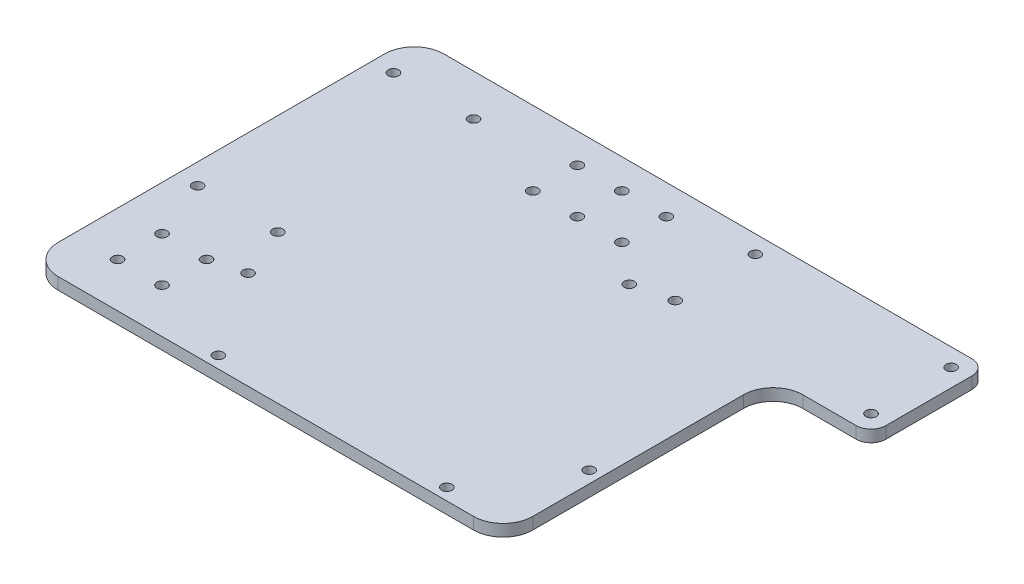
ISO-10303-21;
HEADER;
FILE_DESCRIPTION(('STEP AP214'),'2;1');
FILE_NAME('part.step','',(''),(''),'','','');
FILE_SCHEMA(('AUTOMOTIVE_DESIGN { 1 0 10303 214 1 1 1 1 }'));
ENDSEC;
DATA;
#1=APPLICATION_CONTEXT('core data for automotive mechanical design processes');
#2=APPLICATION_PROTOCOL_DEFINITION('international standard','automotive_design',2000,#1);
#3=PRODUCT_CONTEXT('',#1,'mechanical');
#4=PRODUCT('Part','Part','',(#3));
#5=PRODUCT_RELATED_PRODUCT_CATEGORY('part','',(#4));
#6=PRODUCT_DEFINITION_FORMATION('','',#4);
#7=PRODUCT_DEFINITION_CONTEXT('part definition',#1,'design');
#8=PRODUCT_DEFINITION('design','',#6,#7);
#9=PRODUCT_DEFINITION_SHAPE('','',#8);
#10=(LENGTH_UNIT() NAMED_UNIT(*) SI_UNIT(.MILLI.,.METRE.));
#11=(NAMED_UNIT(*) PLANE_ANGLE_UNIT() SI_UNIT($,.RADIAN.));
#12=(NAMED_UNIT(*) SI_UNIT($,.STERADIAN.) SOLID_ANGLE_UNIT());
#13=UNCERTAINTY_MEASURE_WITH_UNIT(LENGTH_MEASURE(1.E-05),#10,'distance_accuracy_value','');
#14=(GEOMETRIC_REPRESENTATION_CONTEXT(3) GLOBAL_UNCERTAINTY_ASSIGNED_CONTEXT((#13)) GLOBAL_UNIT_ASSIGNED_CONTEXT((#10,
#11,#12)) REPRESENTATION_CONTEXT('',''));
#15=CARTESIAN_POINT('',(0.,0.,0.));
#16=DIRECTION('',(0.,0.,1.));
#17=DIRECTION('',(1.,0.,0.));
#18=AXIS2_PLACEMENT_3D('',#15,#16,#17);
#19=CARTESIAN_POINT('',(80.,4.,-65.));
#20=DIRECTION('',(-1.,0.,0.));
#21=DIRECTION('',(0.,0.,1.));
#22=AXIS2_PLACEMENT_3D('',#19,#20,#21);
#23=PLANE('',#22);
#24=DIRECTION('',(0.,0.,-1.));
#25=VECTOR('',#24,1.);
#26=CARTESIAN_POINT('',(80.,0.,-65.));
#27=LINE('',#26,#25);
#28=CARTESIAN_POINT('',(80.,0.,55.));
#29=VERTEX_POINT('',#28);
#30=CARTESIAN_POINT('',(80.,0.,-16.));
#31=VERTEX_POINT('',#30);
#32=EDGE_CURVE('E144',#29,#31,#27,.T.);
#33=ORIENTED_EDGE('',*,*,#32,.T.);
#34=DIRECTION('',(0.,1.,0.));
#35=VECTOR('',#34,1.);
#36=CARTESIAN_POINT('',(80.,4.,-16.));
#37=LINE('',#36,#35);
#38=CARTESIAN_POINT('',(80.,4.,-16.));
#39=VERTEX_POINT('',#38);
#40=EDGE_CURVE('E148',#31,#39,#37,.T.);
#41=ORIENTED_EDGE('',*,*,#40,.T.);
#42=DIRECTION('',(0.,0.,-1.));
#43=VECTOR('',#42,1.);
#44=CARTESIAN_POINT('',(80.,4.,-65.));
#45=LINE('',#44,#43);
#46=CARTESIAN_POINT('',(80.,4.,55.));
#47=VERTEX_POINT('',#46);
#48=EDGE_CURVE('E147',#47,#39,#45,.T.);
#49=ORIENTED_EDGE('',*,*,#48,.F.);
#50=DIRECTION('',(0.,-1.,0.));
#51=VECTOR('',#50,1.);
#52=CARTESIAN_POINT('',(80.,4.,55.));
#53=LINE('',#52,#51);
#54=EDGE_CURVE('E132',#47,#29,#53,.T.);
#55=ORIENTED_EDGE('',*,*,#54,.T.);
#56=EDGE_LOOP('',(#33,#41,#49,#55));
#57=FACE_BOUND('',#56,.T.);
#58=ADVANCED_FACE('F37',(#57),#23,.F.);
#59=CARTESIAN_POINT('',(-80.,4.,-65.));
#60=DIRECTION('',(0.,0.,1.));
#61=DIRECTION('',(1.,0.,0.));
#62=AXIS2_PLACEMENT_3D('',#59,#60,#61);
#63=PLANE('',#62);
#64=DIRECTION('',(-1.,0.,0.));
#65=VECTOR('',#64,1.);
#66=CARTESIAN_POINT('',(-80.,4.,-65.));
#67=LINE('',#66,#65);
#68=CARTESIAN_POINT('',(108.,4.,-65.));
#69=VERTEX_POINT('',#68);
#70=CARTESIAN_POINT('',(-70.,4.,-65.));
#71=VERTEX_POINT('',#70);
#72=EDGE_CURVE('E199',#69,#71,#67,.T.);
#73=ORIENTED_EDGE('',*,*,#72,.F.);
#74=DIRECTION('',(0.,1.,0.));
#75=VECTOR('',#74,1.);
#76=CARTESIAN_POINT('',(108.,0.,-65.));
#77=LINE('',#76,#75);
#78=CARTESIAN_POINT('',(108.,0.,-65.));
#79=VERTEX_POINT('',#78);
#80=EDGE_CURVE('E60',#69,#79,#77,.F.);
#81=ORIENTED_EDGE('',*,*,#80,.T.);
#82=DIRECTION('',(-1.,0.,0.));
#83=VECTOR('',#82,1.);
#84=CARTESIAN_POINT('',(-80.,0.,-65.));
#85=LINE('',#84,#83);
#86=CARTESIAN_POINT('',(-70.,0.,-65.));
#87=VERTEX_POINT('',#86);
#88=EDGE_CURVE('E154',#79,#87,#85,.T.);
#89=ORIENTED_EDGE('',*,*,#88,.T.);
#90=DIRECTION('',(0.,-1.,0.));
#91=VECTOR('',#90,1.);
#92=CARTESIAN_POINT('',(-70.,4.,-65.));
#93=LINE('',#92,#91);
#94=EDGE_CURVE('E257',#87,#71,#93,.F.);
#95=ORIENTED_EDGE('',*,*,#94,.T.);
#96=EDGE_LOOP('',(#73,#81,#89,#95));
#97=FACE_BOUND('',#96,.T.);
#98=ADVANCED_FACE('F289',(#97),#63,.F.);
#99=CARTESIAN_POINT('',(-80.,4.,-65.));
#100=DIRECTION('',(1.,0.,0.));
#101=DIRECTION('',(0.,0.,-1.));
#102=AXIS2_PLACEMENT_3D('',#99,#100,#101);
#103=PLANE('',#102);
#104=DIRECTION('',(0.,0.,1.));
#105=VECTOR('',#104,1.);
#106=CARTESIAN_POINT('',(-80.,0.,-65.));
#107=LINE('',#106,#105);
#108=CARTESIAN_POINT('',(-80.,0.,-55.));
#109=VERTEX_POINT('',#108);
#110=CARTESIAN_POINT('',(-80.,0.,55.));
#111=VERTEX_POINT('',#110);
#112=EDGE_CURVE('E157',#109,#111,#107,.T.);
#113=ORIENTED_EDGE('',*,*,#112,.T.);
#114=DIRECTION('',(0.,-1.,0.));
#115=VECTOR('',#114,1.);
#116=CARTESIAN_POINT('',(-80.,4.,55.));
#117=LINE('',#116,#115);
#118=CARTESIAN_POINT('',(-80.,4.,55.));
#119=VERTEX_POINT('',#118);
#120=EDGE_CURVE('E260',#111,#119,#117,.F.);
#121=ORIENTED_EDGE('',*,*,#120,.T.);
#122=DIRECTION('',(0.,0.,1.));
#123=VECTOR('',#122,1.);
#124=CARTESIAN_POINT('',(-80.,4.,-65.));
#125=LINE('',#124,#123);
#126=CARTESIAN_POINT('',(-80.,4.,-55.));
#127=VERTEX_POINT('',#126);
#128=EDGE_CURVE('E195',#127,#119,#125,.T.);
#129=ORIENTED_EDGE('',*,*,#128,.F.);
#130=DIRECTION('',(0.,-1.,0.));
#131=VECTOR('',#130,1.);
#132=CARTESIAN_POINT('',(-80.,4.,-55.));
#133=LINE('',#132,#131);
#134=EDGE_CURVE('E262',#127,#109,#133,.T.);
#135=ORIENTED_EDGE('',*,*,#134,.T.);
#136=EDGE_LOOP('',(#113,#121,#129,#135));
#137=FACE_BOUND('',#136,.T.);
#138=ADVANCED_FACE('F283',(#137),#103,.F.);
#139=CARTESIAN_POINT('',(-80.,4.,65.));
#140=DIRECTION('',(0.,0.,-1.));
#141=DIRECTION('',(-1.,0.,0.));
#142=AXIS2_PLACEMENT_3D('',#139,#140,#141);
#143=PLANE('',#142);
#144=DIRECTION('',(1.,0.,0.));
#145=VECTOR('',#144,1.);
#146=CARTESIAN_POINT('',(-80.,0.,65.));
#147=LINE('',#146,#145);
#148=CARTESIAN_POINT('',(-70.,0.,65.));
#149=VERTEX_POINT('',#148);
#150=CARTESIAN_POINT('',(70.,0.,65.));
#151=VERTEX_POINT('',#150);
#152=EDGE_CURVE('E168',#149,#151,#147,.T.);
#153=ORIENTED_EDGE('',*,*,#152,.T.);
#154=DIRECTION('',(0.,-1.,0.));
#155=VECTOR('',#154,1.);
#156=CARTESIAN_POINT('',(70.,4.,65.));
#157=LINE('',#156,#155);
#158=CARTESIAN_POINT('',(70.,4.,65.));
#159=VERTEX_POINT('',#158);
#160=EDGE_CURVE('E133',#151,#159,#157,.F.);
#161=ORIENTED_EDGE('',*,*,#160,.T.);
#162=DIRECTION('',(1.,0.,0.));
#163=VECTOR('',#162,1.);
#164=CARTESIAN_POINT('',(-80.,4.,65.));
#165=LINE('',#164,#163);
#166=CARTESIAN_POINT('',(-70.,4.,65.));
#167=VERTEX_POINT('',#166);
#168=EDGE_CURVE('E149',#167,#159,#165,.T.);
#169=ORIENTED_EDGE('',*,*,#168,.F.);
#170=DIRECTION('',(0.,-1.,0.));
#171=VECTOR('',#170,1.);
#172=CARTESIAN_POINT('',(-70.,4.,65.));
#173=LINE('',#172,#171);
#174=EDGE_CURVE('E137',#167,#149,#173,.T.);
#175=ORIENTED_EDGE('',*,*,#174,.T.);
#176=EDGE_LOOP('',(#153,#161,#169,#175));
#177=FACE_BOUND('',#176,.T.);
#178=ADVANCED_FACE('F279',(#177),#143,.F.);
#179=CARTESIAN_POINT('',(0.,4.,0.));
#180=DIRECTION('',(0.,1.,0.));
#181=DIRECTION('',(0.,0.,1.));
#182=AXIS2_PLACEMENT_3D('',#179,#180,#181);
#183=PLANE('',#182);
#184=CARTESIAN_POINT('',(-50.,4.,50.));
#185=DIRECTION('',(0.,1.,0.));
#186=DIRECTION('',(0.,0.,1.));
#187=AXIS2_PLACEMENT_3D('',#184,#185,#186);
#188=CIRCLE('',#187,1.75);
#189=CARTESIAN_POINT('',(-50.,4.,51.75));
#190=VERTEX_POINT('',#189);
#191=EDGE_CURVE('E713',#190,#190,#188,.T.);
#192=ORIENTED_EDGE('',*,*,#191,.F.);
#193=EDGE_LOOP('',(#192));
#194=FACE_BOUND('',#193,.T.);
#195=CARTESIAN_POINT('',(-65.,4.,35.));
#196=DIRECTION('',(0.,1.,0.));
#197=DIRECTION('',(0.,0.,1.));
#198=AXIS2_PLACEMENT_3D('',#195,#196,#197);
#199=CIRCLE('',#198,1.75);
#200=CARTESIAN_POINT('',(-65.,4.,36.75));
#201=VERTEX_POINT('',#200);
#202=EDGE_CURVE('E430',#201,#201,#199,.T.);
#203=ORIENTED_EDGE('',*,*,#202,.F.);
#204=EDGE_LOOP('',(#203));
#205=FACE_BOUND('',#204,.T.);
#206=CARTESIAN_POINT('',(-50.,4.,35.));
#207=DIRECTION('',(0.,1.,0.));
#208=DIRECTION('',(0.,0.,1.));
#209=AXIS2_PLACEMENT_3D('',#206,#207,#208);
#210=CIRCLE('',#209,1.75);
#211=CARTESIAN_POINT('',(-50.,4.,36.75));
#212=VERTEX_POINT('',#211);
#213=EDGE_CURVE('E424',#212,#212,#210,.T.);
#214=ORIENTED_EDGE('',*,*,#213,.F.);
#215=EDGE_LOOP('',(#214));
#216=FACE_BOUND('',#215,.T.);
#217=CARTESIAN_POINT('',(-65.,4.,50.));
#218=DIRECTION('',(0.,1.,0.));
#219=DIRECTION('',(0.,0.,1.));
#220=AXIS2_PLACEMENT_3D('',#217,#218,#219);
#221=CIRCLE('',#220,1.75);
#222=CARTESIAN_POINT('',(-65.,4.,51.75));
#223=VERTEX_POINT('',#222);
#224=EDGE_CURVE('E445',#223,#223,#221,.T.);
#225=ORIENTED_EDGE('',*,*,#224,.F.);
#226=EDGE_LOOP('',(#225));
#227=FACE_BOUND('',#226,.T.);
#228=CARTESIAN_POINT('',(107.,4.,-59.));
#229=DIRECTION('',(0.,1.,0.));
#230=DIRECTION('',(0.,0.,1.));
#231=AXIS2_PLACEMENT_3D('',#228,#229,#230);
#232=CIRCLE('',#231,1.75);
#233=CARTESIAN_POINT('',(107.,4.,-57.25));
#234=VERTEX_POINT('',#233);
#235=EDGE_CURVE('E452',#234,#234,#232,.T.);
#236=ORIENTED_EDGE('',*,*,#235,.F.);
#237=EDGE_LOOP('',(#236));
#238=FACE_BOUND('',#237,.T.);
#239=CARTESIAN_POINT('',(107.,4.,-32.));
#240=DIRECTION('',(0.,1.,0.));
#241=DIRECTION('',(0.,0.,1.));
#242=AXIS2_PLACEMENT_3D('',#239,#240,#241);
#243=CIRCLE('',#242,1.75);
#244=CARTESIAN_POINT('',(107.,4.,-30.25));
#245=VERTEX_POINT('',#244);
#246=EDGE_CURVE('E459',#245,#245,#243,.T.);
#247=ORIENTED_EDGE('',*,*,#246,.F.);
#248=EDGE_LOOP('',(#247));
#249=FACE_BOUND('',#248,.T.);
#250=CARTESIAN_POINT('',(-15.,4.,-54.9999999999999));
#251=DIRECTION('',(0.,1.,0.));
#252=DIRECTION('',(0.,0.,1.));
#253=AXIS2_PLACEMENT_3D('',#250,#251,#252);
#254=CIRCLE('',#253,1.75);
#255=CARTESIAN_POINT('',(-15.,4.,-53.2499999999999));
#256=VERTEX_POINT('',#255);
#257=EDGE_CURVE('E468',#256,#256,#254,.T.);
#258=ORIENTED_EDGE('',*,*,#257,.F.);
#259=EDGE_LOOP('',(#258));
#260=FACE_BOUND('',#259,.T.);
#261=CARTESIAN_POINT('',(15.,4.,-40.));
#262=DIRECTION('',(0.,1.,0.));
#263=DIRECTION('',(0.,0.,1.));
#264=AXIS2_PLACEMENT_3D('',#261,#262,#263);
#265=CIRCLE('',#264,1.75);
#266=CARTESIAN_POINT('',(15.,4.,-38.25));
#267=VERTEX_POINT('',#266);
#268=EDGE_CURVE('E501',#267,#267,#265,.T.);
#269=ORIENTED_EDGE('',*,*,#268,.F.);
#270=EDGE_LOOP('',(#269));
#271=FACE_BOUND('',#270,.T.);
#272=CARTESIAN_POINT('',(15.,4.,-55.));
#273=DIRECTION('',(0.,1.,0.));
#274=DIRECTION('',(0.,0.,1.));
#275=AXIS2_PLACEMENT_3D('',#272,#273,#274);
#276=CIRCLE('',#275,1.75);
#277=CARTESIAN_POINT('',(15.,4.,-53.25));
#278=VERTEX_POINT('',#277);
#279=EDGE_CURVE('E500',#278,#278,#276,.T.);
#280=ORIENTED_EDGE('',*,*,#279,.F.);
#281=EDGE_LOOP('',(#280));
#282=FACE_BOUND('',#281,.T.);
#283=CARTESIAN_POINT('',(0.,4.,-40.));
#284=DIRECTION('',(0.,1.,0.));
#285=DIRECTION('',(0.,0.,1.));
#286=AXIS2_PLACEMENT_3D('',#283,#284,#285);
#287=CIRCLE('',#286,1.75);
#288=CARTESIAN_POINT('',(0.,4.,-38.25));
#289=VERTEX_POINT('',#288);
#290=EDGE_CURVE('E480',#289,#289,#287,.T.);
#291=ORIENTED_EDGE('',*,*,#290,.F.);
#292=EDGE_LOOP('',(#291));
#293=FACE_BOUND('',#292,.T.);
#294=CARTESIAN_POINT('',(-15.,4.,-39.9999999999999));
#295=DIRECTION('',(0.,1.,0.));
#296=DIRECTION('',(0.,0.,1.));
#297=AXIS2_PLACEMENT_3D('',#294,#295,#296);
#298=CIRCLE('',#297,1.75);
#299=CARTESIAN_POINT('',(-15.,4.,-38.2499999999999));
#300=VERTEX_POINT('',#299);
#301=EDGE_CURVE('E493',#300,#300,#298,.T.);
#302=ORIENTED_EDGE('',*,*,#301,.F.);
#303=EDGE_LOOP('',(#302));
#304=FACE_BOUND('',#303,.T.);
#305=CARTESIAN_POINT('',(0.,4.,-55.));
#306=DIRECTION('',(0.,1.,0.));
#307=DIRECTION('',(0.,0.,1.));
#308=AXIS2_PLACEMENT_3D('',#305,#306,#307);
#309=CIRCLE('',#308,1.75);
#310=CARTESIAN_POINT('',(0.,4.,-53.25));
#311=VERTEX_POINT('',#310);
#312=EDGE_CURVE('E479',#311,#311,#309,.T.);
#313=ORIENTED_EDGE('',*,*,#312,.F.);
#314=EDGE_LOOP('',(#313));
#315=FACE_BOUND('',#314,.T.);
#316=CARTESIAN_POINT('',(28.5,4.,-29.));
#317=DIRECTION('',(0.,1.,0.));
#318=DIRECTION('',(0.,0.,1.));
#319=AXIS2_PLACEMENT_3D('',#316,#317,#318);
#320=CIRCLE('',#319,1.75);
#321=CARTESIAN_POINT('',(28.5,4.,-27.25));
#322=VERTEX_POINT('',#321);
#323=EDGE_CURVE('E530',#322,#322,#320,.T.);
#324=ORIENTED_EDGE('',*,*,#323,.F.);
#325=EDGE_LOOP('',(#324));
#326=FACE_BOUND('',#325,.T.);
#327=CARTESIAN_POINT('',(76.,4.,32.));
#328=DIRECTION('',(0.,1.,0.));
#329=DIRECTION('',(0.,0.,1.));
#330=AXIS2_PLACEMENT_3D('',#327,#328,#329);
#331=CIRCLE('',#330,1.75);
#332=CARTESIAN_POINT('',(76.,4.,33.75));
#333=VERTEX_POINT('',#332);
#334=EDGE_CURVE('E534',#333,#333,#331,.T.);
#335=ORIENTED_EDGE('',*,*,#334,.F.);
#336=EDGE_LOOP('',(#335));
#337=FACE_BOUND('',#336,.T.);
#338=CARTESIAN_POINT('',(-39.,4.,32.));
#339=DIRECTION('',(0.,1.,0.));
#340=DIRECTION('',(0.,0.,1.));
#341=AXIS2_PLACEMENT_3D('',#338,#339,#340);
#342=CIRCLE('',#341,1.75);
#343=CARTESIAN_POINT('',(-39.,4.,33.75));
#344=VERTEX_POINT('',#343);
#345=EDGE_CURVE('E538',#344,#344,#342,.T.);
#346=ORIENTED_EDGE('',*,*,#345,.F.);
#347=EDGE_LOOP('',(#346));
#348=FACE_BOUND('',#347,.T.);
#349=CARTESIAN_POINT('',(-20.,4.,61.));
#350=DIRECTION('',(0.,1.,0.));
#351=DIRECTION('',(0.,0.,1.));
#352=AXIS2_PLACEMENT_3D('',#349,#350,#351);
#353=CIRCLE('',#352,1.75);
#354=CARTESIAN_POINT('',(-20.,4.,62.75));
#355=VERTEX_POINT('',#354);
#356=EDGE_CURVE('E542',#355,#355,#353,.T.);
#357=ORIENTED_EDGE('',*,*,#356,.F.);
#358=EDGE_LOOP('',(#357));
#359=FACE_BOUND('',#358,.T.);
#360=CARTESIAN_POINT('',(57.,4.,61.));
#361=DIRECTION('',(0.,1.,0.));
#362=DIRECTION('',(0.,0.,1.));
#363=AXIS2_PLACEMENT_3D('',#360,#361,#362);
#364=CIRCLE('',#363,1.75);
#365=CARTESIAN_POINT('',(57.,4.,62.75));
#366=VERTEX_POINT('',#365);
#367=EDGE_CURVE('E546',#366,#366,#364,.T.);
#368=ORIENTED_EDGE('',*,*,#367,.F.);
#369=EDGE_LOOP('',(#368));
#370=FACE_BOUND('',#369,.T.);
#371=CARTESIAN_POINT('',(41.,4.,-59.));
#372=DIRECTION('',(0.,1.,0.));
#373=DIRECTION('',(0.,0.,1.));
#374=AXIS2_PLACEMENT_3D('',#371,#372,#373);
#375=CIRCLE('',#374,1.75);
#376=CARTESIAN_POINT('',(41.,4.,-57.25));
#377=VERTEX_POINT('',#376);
#378=EDGE_CURVE('E550',#377,#377,#375,.T.);
#379=ORIENTED_EDGE('',*,*,#378,.F.);
#380=EDGE_LOOP('',(#379));
#381=FACE_BOUND('',#380,.T.);
#382=CARTESIAN_POINT('',(41.,4.,-32.));
#383=DIRECTION('',(0.,1.,0.));
#384=DIRECTION('',(0.,0.,1.));
#385=AXIS2_PLACEMENT_3D('',#382,#383,#384);
#386=CIRCLE('',#385,1.75000000000001);
#387=CARTESIAN_POINT('',(41.,4.,-30.25));
#388=VERTEX_POINT('',#387);
#389=EDGE_CURVE('E554',#388,#388,#386,.T.);
#390=ORIENTED_EDGE('',*,*,#389,.F.);
#391=EDGE_LOOP('',(#390));
#392=FACE_BOUND('',#391,.T.);
#393=CARTESIAN_POINT('',(-73.,4.,-51.));
#394=DIRECTION('',(0.,1.,0.));
#395=DIRECTION('',(0.,0.,1.));
#396=AXIS2_PLACEMENT_3D('',#393,#394,#395);
#397=CIRCLE('',#396,1.75);
#398=CARTESIAN_POINT('',(-73.,4.,-49.25));
#399=VERTEX_POINT('',#398);
#400=EDGE_CURVE('E558',#399,#399,#397,.T.);
#401=ORIENTED_EDGE('',*,*,#400,.F.);
#402=EDGE_LOOP('',(#401));
#403=FACE_BOUND('',#402,.T.);
#404=CARTESIAN_POINT('',(-46.,4.,15.));
#405=DIRECTION('',(0.,1.,0.));
#406=DIRECTION('',(0.,0.,1.));
#407=AXIS2_PLACEMENT_3D('',#404,#405,#406);
#408=CIRCLE('',#407,1.75);
#409=CARTESIAN_POINT('',(-46.,4.,16.75));
#410=VERTEX_POINT('',#409);
#411=EDGE_CURVE('E562',#410,#410,#408,.T.);
#412=ORIENTED_EDGE('',*,*,#411,.F.);
#413=EDGE_LOOP('',(#412));
#414=FACE_BOUND('',#413,.T.);
#415=CARTESIAN_POINT('',(-46.,4.,-51.));
#416=DIRECTION('',(0.,1.,0.));
#417=DIRECTION('',(0.,0.,1.));
#418=AXIS2_PLACEMENT_3D('',#415,#416,#417);
#419=CIRCLE('',#418,1.75);
#420=CARTESIAN_POINT('',(-46.,4.,-49.25));
#421=VERTEX_POINT('',#420);
#422=EDGE_CURVE('E566',#421,#421,#419,.T.);
#423=ORIENTED_EDGE('',*,*,#422,.F.);
#424=EDGE_LOOP('',(#423));
#425=FACE_BOUND('',#424,.T.);
#426=CARTESIAN_POINT('',(-73.,4.,15.));
#427=DIRECTION('',(0.,1.,0.));
#428=DIRECTION('',(0.,0.,1.));
#429=AXIS2_PLACEMENT_3D('',#426,#427,#428);
#430=CIRCLE('',#429,1.75);
#431=CARTESIAN_POINT('',(-73.,4.,16.75));
#432=VERTEX_POINT('',#431);
#433=EDGE_CURVE('E160',#432,#432,#430,.T.);
#434=ORIENTED_EDGE('',*,*,#433,.F.);
#435=EDGE_LOOP('',(#434));
#436=FACE_BOUND('',#435,.T.);
#437=DIRECTION('',(0.,0.,-1.));
#438=VECTOR('',#437,1.);
#439=CARTESIAN_POINT('',(113.,4.,-65.));
#440=LINE('',#439,#438);
#441=CARTESIAN_POINT('',(113.,4.,-31.));
#442=VERTEX_POINT('',#441);
#443=CARTESIAN_POINT('',(113.,4.,-60.));
#444=VERTEX_POINT('',#443);
#445=EDGE_CURVE('E216',#442,#444,#440,.T.);
#446=ORIENTED_EDGE('',*,*,#445,.T.);
#447=CARTESIAN_POINT('',(108.,4.,-60.));
#448=DIRECTION('',(0.,1.,0.));
#449=DIRECTION('',(0.,0.,1.));
#450=AXIS2_PLACEMENT_3D('',#447,#448,#449);
#451=CIRCLE('',#450,5.);
#452=EDGE_CURVE('E230',#444,#69,#451,.T.);
#453=ORIENTED_EDGE('',*,*,#452,.T.);
#454=ORIENTED_EDGE('',*,*,#72,.T.);
#455=CARTESIAN_POINT('',(-70.,4.,-55.));
#456=DIRECTION('',(0.,1.,0.));
#457=DIRECTION('',(0.,0.,1.));
#458=AXIS2_PLACEMENT_3D('',#455,#456,#457);
#459=CIRCLE('',#458,10.);
#460=EDGE_CURVE('E181',#71,#127,#459,.T.);
#461=ORIENTED_EDGE('',*,*,#460,.T.);
#462=ORIENTED_EDGE('',*,*,#128,.T.);
#463=CARTESIAN_POINT('',(-70.,4.,55.));
#464=DIRECTION('',(0.,1.,0.));
#465=DIRECTION('',(0.,0.,1.));
#466=AXIS2_PLACEMENT_3D('',#463,#464,#465);
#467=CIRCLE('',#466,10.);
#468=EDGE_CURVE('E185',#119,#167,#467,.T.);
#469=ORIENTED_EDGE('',*,*,#468,.T.);
#470=ORIENTED_EDGE('',*,*,#168,.T.);
#471=CARTESIAN_POINT('',(70.,4.,55.));
#472=DIRECTION('',(0.,1.,0.));
#473=DIRECTION('',(0.,0.,1.));
#474=AXIS2_PLACEMENT_3D('',#471,#472,#473);
#475=CIRCLE('',#474,10.);
#476=EDGE_CURVE('E264',#159,#47,#475,.T.);
#477=ORIENTED_EDGE('',*,*,#476,.T.);
#478=ORIENTED_EDGE('',*,*,#48,.T.);
#479=CARTESIAN_POINT('',(90.,4.,-16.));
#480=DIRECTION('',(0.,1.,0.));
#481=DIRECTION('',(0.,0.,1.));
#482=AXIS2_PLACEMENT_3D('',#479,#480,#481);
#483=CIRCLE('',#482,10.);
#484=CARTESIAN_POINT('',(90.,4.,-26.));
#485=VERTEX_POINT('',#484);
#486=EDGE_CURVE('E254',#39,#485,#483,.F.);
#487=ORIENTED_EDGE('',*,*,#486,.T.);
#488=DIRECTION('',(1.,0.,0.));
#489=VECTOR('',#488,1.);
#490=CARTESIAN_POINT('',(80.,4.,-26.));
#491=LINE('',#490,#489);
#492=CARTESIAN_POINT('',(108.,4.,-26.));
#493=VERTEX_POINT('',#492);
#494=EDGE_CURVE('E210',#485,#493,#491,.T.);
#495=ORIENTED_EDGE('',*,*,#494,.T.);
#496=CARTESIAN_POINT('',(108.,4.,-31.));
#497=DIRECTION('',(0.,1.,0.));
#498=DIRECTION('',(0.,0.,1.));
#499=AXIS2_PLACEMENT_3D('',#496,#497,#498);
#500=CIRCLE('',#499,5.);
#501=EDGE_CURVE('E234',#493,#442,#500,.T.);
#502=ORIENTED_EDGE('',*,*,#501,.T.);
#503=EDGE_LOOP('',(#446,#453,#454,#461,#462,#469,#470,#477,#478,#487,#495,#502));
#504=FACE_BOUND('',#503,.T.);
#505=ADVANCED_FACE('F273',(#194,#205,#216,#227,#238,#249,#260,#271,#282,#293,#304,#315,#326,
#337,#348,#359,#370,#381,#392,#403,#414,#425,#436,#504),#183,.T.);
#506=CARTESIAN_POINT('',(0.,0.,0.));
#507=DIRECTION('',(0.,1.,0.));
#508=DIRECTION('',(0.,0.,1.));
#509=AXIS2_PLACEMENT_3D('',#506,#507,#508);
#510=PLANE('',#509);
#511=CARTESIAN_POINT('',(-50.,0.,50.));
#512=DIRECTION('',(0.,1.,0.));
#513=DIRECTION('',(0.,0.,1.));
#514=AXIS2_PLACEMENT_3D('',#511,#512,#513);
#515=CIRCLE('',#514,1.75);
#516=CARTESIAN_POINT('',(-50.,0.,51.75));
#517=VERTEX_POINT('',#516);
#518=EDGE_CURVE('E434',#517,#517,#515,.T.);
#519=ORIENTED_EDGE('',*,*,#518,.T.);
#520=EDGE_LOOP('',(#519));
#521=FACE_BOUND('',#520,.T.);
#522=CARTESIAN_POINT('',(-65.,0.,35.));
#523=DIRECTION('',(0.,1.,0.));
#524=DIRECTION('',(0.,0.,1.));
#525=AXIS2_PLACEMENT_3D('',#522,#523,#524);
#526=CIRCLE('',#525,1.75);
#527=CARTESIAN_POINT('',(-65.,0.,36.75));
#528=VERTEX_POINT('',#527);
#529=EDGE_CURVE('E711',#528,#528,#526,.T.);
#530=ORIENTED_EDGE('',*,*,#529,.T.);
#531=EDGE_LOOP('',(#530));
#532=FACE_BOUND('',#531,.T.);
#533=CARTESIAN_POINT('',(-50.,0.,35.));
#534=DIRECTION('',(0.,1.,0.));
#535=DIRECTION('',(0.,0.,1.));
#536=AXIS2_PLACEMENT_3D('',#533,#534,#535);
#537=CIRCLE('',#536,1.75);
#538=CARTESIAN_POINT('',(-50.,0.,36.75));
#539=VERTEX_POINT('',#538);
#540=EDGE_CURVE('E421',#539,#539,#537,.T.);
#541=ORIENTED_EDGE('',*,*,#540,.T.);
#542=EDGE_LOOP('',(#541));
#543=FACE_BOUND('',#542,.T.);
#544=CARTESIAN_POINT('',(-65.,0.,50.));
#545=DIRECTION('',(0.,1.,0.));
#546=DIRECTION('',(0.,0.,1.));
#547=AXIS2_PLACEMENT_3D('',#544,#545,#546);
#548=CIRCLE('',#547,1.75);
#549=CARTESIAN_POINT('',(-65.,0.,51.75));
#550=VERTEX_POINT('',#549);
#551=EDGE_CURVE('E450',#550,#550,#548,.T.);
#552=ORIENTED_EDGE('',*,*,#551,.T.);
#553=EDGE_LOOP('',(#552));
#554=FACE_BOUND('',#553,.T.);
#555=CARTESIAN_POINT('',(107.,0.,-59.));
#556=DIRECTION('',(0.,1.,0.));
#557=DIRECTION('',(0.,0.,1.));
#558=AXIS2_PLACEMENT_3D('',#555,#556,#557);
#559=CIRCLE('',#558,1.75);
#560=CARTESIAN_POINT('',(107.,0.,-57.25));
#561=VERTEX_POINT('',#560);
#562=EDGE_CURVE('E217',#561,#561,#559,.T.);
#563=ORIENTED_EDGE('',*,*,#562,.T.);
#564=EDGE_LOOP('',(#563));
#565=FACE_BOUND('',#564,.T.);
#566=CARTESIAN_POINT('',(107.,0.,-32.));
#567=DIRECTION('',(0.,1.,0.));
#568=DIRECTION('',(0.,0.,1.));
#569=AXIS2_PLACEMENT_3D('',#566,#567,#568);
#570=CIRCLE('',#569,1.75);
#571=CARTESIAN_POINT('',(107.,0.,-30.25));
#572=VERTEX_POINT('',#571);
#573=EDGE_CURVE('E457',#572,#572,#570,.T.);
#574=ORIENTED_EDGE('',*,*,#573,.T.);
#575=EDGE_LOOP('',(#574));
#576=FACE_BOUND('',#575,.T.);
#577=CARTESIAN_POINT('',(-15.,0.,-54.9999999999999));
#578=DIRECTION('',(0.,1.,0.));
#579=DIRECTION('',(0.,0.,1.));
#580=AXIS2_PLACEMENT_3D('',#577,#578,#579);
#581=CIRCLE('',#580,1.75);
#582=CARTESIAN_POINT('',(-15.,0.,-53.2499999999999));
#583=VERTEX_POINT('',#582);
#584=EDGE_CURVE('E474',#583,#583,#581,.T.);
#585=ORIENTED_EDGE('',*,*,#584,.T.);
#586=EDGE_LOOP('',(#585));
#587=FACE_BOUND('',#586,.T.);
#588=CARTESIAN_POINT('',(15.,0.,-40.));
#589=DIRECTION('',(0.,1.,0.));
#590=DIRECTION('',(0.,0.,1.));
#591=AXIS2_PLACEMENT_3D('',#588,#589,#590);
#592=CIRCLE('',#591,1.75);
#593=CARTESIAN_POINT('',(15.,0.,-38.25));
#594=VERTEX_POINT('',#593);
#595=EDGE_CURVE('E498',#594,#594,#592,.T.);
#596=ORIENTED_EDGE('',*,*,#595,.T.);
#597=EDGE_LOOP('',(#596));
#598=FACE_BOUND('',#597,.T.);
#599=CARTESIAN_POINT('',(15.,0.,-55.));
#600=DIRECTION('',(0.,1.,0.));
#601=DIRECTION('',(0.,0.,1.));
#602=AXIS2_PLACEMENT_3D('',#599,#600,#601);
#603=CIRCLE('',#602,1.75);
#604=CARTESIAN_POINT('',(15.,0.,-53.25));
#605=VERTEX_POINT('',#604);
#606=EDGE_CURVE('E485',#605,#605,#603,.T.);
#607=ORIENTED_EDGE('',*,*,#606,.T.);
#608=EDGE_LOOP('',(#607));
#609=FACE_BOUND('',#608,.T.);
#610=CARTESIAN_POINT('',(0.,0.,-40.));
#611=DIRECTION('',(0.,1.,0.));
#612=DIRECTION('',(0.,0.,1.));
#613=AXIS2_PLACEMENT_3D('',#610,#611,#612);
#614=CIRCLE('',#613,1.75);
#615=CARTESIAN_POINT('',(0.,0.,-38.25));
#616=VERTEX_POINT('',#615);
#617=EDGE_CURVE('E476',#616,#616,#614,.T.);
#618=ORIENTED_EDGE('',*,*,#617,.T.);
#619=EDGE_LOOP('',(#618));
#620=FACE_BOUND('',#619,.T.);
#621=CARTESIAN_POINT('',(-15.,0.,-39.9999999999999));
#622=DIRECTION('',(0.,1.,0.));
#623=DIRECTION('',(0.,0.,1.));
#624=AXIS2_PLACEMENT_3D('',#621,#622,#623);
#625=CIRCLE('',#624,1.75);
#626=CARTESIAN_POINT('',(-15.,0.,-38.2499999999999));
#627=VERTEX_POINT('',#626);
#628=EDGE_CURVE('E475',#627,#627,#625,.T.);
#629=ORIENTED_EDGE('',*,*,#628,.T.);
#630=EDGE_LOOP('',(#629));
#631=FACE_BOUND('',#630,.T.);
#632=CARTESIAN_POINT('',(0.,0.,-55.));
#633=DIRECTION('',(0.,1.,0.));
#634=DIRECTION('',(0.,0.,1.));
#635=AXIS2_PLACEMENT_3D('',#632,#633,#634);
#636=CIRCLE('',#635,1.75);
#637=CARTESIAN_POINT('',(0.,0.,-53.25));
#638=VERTEX_POINT('',#637);
#639=EDGE_CURVE('E625',#638,#638,#636,.T.);
#640=ORIENTED_EDGE('',*,*,#639,.T.);
#641=EDGE_LOOP('',(#640));
#642=FACE_BOUND('',#641,.T.);
#643=CARTESIAN_POINT('',(28.5,0.,-29.));
#644=DIRECTION('',(0.,1.,0.));
#645=DIRECTION('',(0.,0.,1.));
#646=AXIS2_PLACEMENT_3D('',#643,#644,#645);
#647=CIRCLE('',#646,1.75);
#648=CARTESIAN_POINT('',(28.5,0.,-27.25));
#649=VERTEX_POINT('',#648);
#650=EDGE_CURVE('E624',#649,#649,#647,.T.);
#651=ORIENTED_EDGE('',*,*,#650,.T.);
#652=EDGE_LOOP('',(#651));
#653=FACE_BOUND('',#652,.T.);
#654=CARTESIAN_POINT('',(76.,0.,32.));
#655=DIRECTION('',(0.,1.,0.));
#656=DIRECTION('',(0.,0.,1.));
#657=AXIS2_PLACEMENT_3D('',#654,#655,#656);
#658=CIRCLE('',#657,1.75);
#659=CARTESIAN_POINT('',(76.,0.,33.75));
#660=VERTEX_POINT('',#659);
#661=EDGE_CURVE('E632',#660,#660,#658,.T.);
#662=ORIENTED_EDGE('',*,*,#661,.T.);
#663=EDGE_LOOP('',(#662));
#664=FACE_BOUND('',#663,.T.);
#665=CARTESIAN_POINT('',(-39.,0.,32.));
#666=DIRECTION('',(0.,1.,0.));
#667=DIRECTION('',(0.,0.,1.));
#668=AXIS2_PLACEMENT_3D('',#665,#666,#667);
#669=CIRCLE('',#668,1.75);
#670=CARTESIAN_POINT('',(-39.,0.,33.75));
#671=VERTEX_POINT('',#670);
#672=EDGE_CURVE('E637',#671,#671,#669,.T.);
#673=ORIENTED_EDGE('',*,*,#672,.T.);
#674=EDGE_LOOP('',(#673));
#675=FACE_BOUND('',#674,.T.);
#676=CARTESIAN_POINT('',(-20.,0.,61.));
#677=DIRECTION('',(0.,1.,0.));
#678=DIRECTION('',(0.,0.,1.));
#679=AXIS2_PLACEMENT_3D('',#676,#677,#678);
#680=CIRCLE('',#679,1.75);
#681=CARTESIAN_POINT('',(-20.,0.,62.75));
#682=VERTEX_POINT('',#681);
#683=EDGE_CURVE('E618',#682,#682,#680,.T.);
#684=ORIENTED_EDGE('',*,*,#683,.T.);
#685=EDGE_LOOP('',(#684));
#686=FACE_BOUND('',#685,.T.);
#687=CARTESIAN_POINT('',(57.,0.,61.));
#688=DIRECTION('',(0.,1.,0.));
#689=DIRECTION('',(0.,0.,1.));
#690=AXIS2_PLACEMENT_3D('',#687,#688,#689);
#691=CIRCLE('',#690,1.75);
#692=CARTESIAN_POINT('',(57.,0.,62.75));
#693=VERTEX_POINT('',#692);
#694=EDGE_CURVE('E604',#693,#693,#691,.T.);
#695=ORIENTED_EDGE('',*,*,#694,.T.);
#696=EDGE_LOOP('',(#695));
#697=FACE_BOUND('',#696,.T.);
#698=CARTESIAN_POINT('',(41.,0.,-59.));
#699=DIRECTION('',(0.,1.,0.));
#700=DIRECTION('',(0.,0.,1.));
#701=AXIS2_PLACEMENT_3D('',#698,#699,#700);
#702=CIRCLE('',#701,1.75);
#703=CARTESIAN_POINT('',(41.,0.,-57.25));
#704=VERTEX_POINT('',#703);
#705=EDGE_CURVE('E599',#704,#704,#702,.T.);
#706=ORIENTED_EDGE('',*,*,#705,.T.);
#707=EDGE_LOOP('',(#706));
#708=FACE_BOUND('',#707,.T.);
#709=CARTESIAN_POINT('',(41.,0.,-32.));
#710=DIRECTION('',(0.,1.,0.));
#711=DIRECTION('',(0.,0.,1.));
#712=AXIS2_PLACEMENT_3D('',#709,#710,#711);
#713=CIRCLE('',#712,1.75000000000001);
#714=CARTESIAN_POINT('',(41.,0.,-30.25));
#715=VERTEX_POINT('',#714);
#716=EDGE_CURVE('E603',#715,#715,#713,.T.);
#717=ORIENTED_EDGE('',*,*,#716,.T.);
#718=EDGE_LOOP('',(#717));
#719=FACE_BOUND('',#718,.T.);
#720=CARTESIAN_POINT('',(-73.,0.,-51.));
#721=DIRECTION('',(0.,1.,0.));
#722=DIRECTION('',(0.,0.,1.));
#723=AXIS2_PLACEMENT_3D('',#720,#721,#722);
#724=CIRCLE('',#723,1.75);
#725=CARTESIAN_POINT('',(-73.,0.,-49.25));
#726=VERTEX_POINT('',#725);
#727=EDGE_CURVE('E571',#726,#726,#724,.T.);
#728=ORIENTED_EDGE('',*,*,#727,.T.);
#729=EDGE_LOOP('',(#728));
#730=FACE_BOUND('',#729,.T.);
#731=CARTESIAN_POINT('',(-46.,0.,15.));
#732=DIRECTION('',(0.,1.,0.));
#733=DIRECTION('',(0.,0.,1.));
#734=AXIS2_PLACEMENT_3D('',#731,#732,#733);
#735=CIRCLE('',#734,1.75);
#736=CARTESIAN_POINT('',(-46.,0.,16.75));
#737=VERTEX_POINT('',#736);
#738=EDGE_CURVE('E578',#737,#737,#735,.T.);
#739=ORIENTED_EDGE('',*,*,#738,.T.);
#740=EDGE_LOOP('',(#739));
#741=FACE_BOUND('',#740,.T.);
#742=CARTESIAN_POINT('',(-46.,0.,-51.));
#743=DIRECTION('',(0.,1.,0.));
#744=DIRECTION('',(0.,0.,1.));
#745=AXIS2_PLACEMENT_3D('',#742,#743,#744);
#746=CIRCLE('',#745,1.75);
#747=CARTESIAN_POINT('',(-46.,0.,-49.25));
#748=VERTEX_POINT('',#747);
#749=EDGE_CURVE('E593',#748,#748,#746,.T.);
#750=ORIENTED_EDGE('',*,*,#749,.T.);
#751=EDGE_LOOP('',(#750));
#752=FACE_BOUND('',#751,.T.);
#753=CARTESIAN_POINT('',(-73.,0.,15.));
#754=DIRECTION('',(0.,1.,0.));
#755=DIRECTION('',(0.,0.,1.));
#756=AXIS2_PLACEMENT_3D('',#753,#754,#755);
#757=CIRCLE('',#756,1.75);
#758=CARTESIAN_POINT('',(-73.,0.,16.75));
#759=VERTEX_POINT('',#758);
#760=EDGE_CURVE('E155',#759,#759,#757,.T.);
#761=ORIENTED_EDGE('',*,*,#760,.T.);
#762=EDGE_LOOP('',(#761));
#763=FACE_BOUND('',#762,.T.);
#764=ORIENTED_EDGE('',*,*,#88,.F.);
#765=CARTESIAN_POINT('',(108.,0.,-60.));
#766=DIRECTION('',(0.,1.,0.));
#767=DIRECTION('',(0.,0.,1.));
#768=AXIS2_PLACEMENT_3D('',#765,#766,#767);
#769=CIRCLE('',#768,5.);
#770=CARTESIAN_POINT('',(113.,0.,-60.));
#771=VERTEX_POINT('',#770);
#772=EDGE_CURVE('E45',#79,#771,#769,.F.);
#773=ORIENTED_EDGE('',*,*,#772,.T.);
#774=DIRECTION('',(0.,0.,1.));
#775=VECTOR('',#774,1.);
#776=CARTESIAN_POINT('',(113.,0.,-65.));
#777=LINE('',#776,#775);
#778=CARTESIAN_POINT('',(113.,0.,-31.));
#779=VERTEX_POINT('',#778);
#780=EDGE_CURVE('E218',#771,#779,#777,.T.);
#781=ORIENTED_EDGE('',*,*,#780,.T.);
#782=CARTESIAN_POINT('',(108.,0.,-31.));
#783=DIRECTION('',(0.,1.,0.));
#784=DIRECTION('',(0.,0.,1.));
#785=AXIS2_PLACEMENT_3D('',#782,#783,#784);
#786=CIRCLE('',#785,5.);
#787=CARTESIAN_POINT('',(108.,0.,-26.));
#788=VERTEX_POINT('',#787);
#789=EDGE_CURVE('E52',#779,#788,#786,.F.);
#790=ORIENTED_EDGE('',*,*,#789,.T.);
#791=DIRECTION('',(-1.,0.,0.));
#792=VECTOR('',#791,1.);
#793=CARTESIAN_POINT('',(80.,0.,-26.));
#794=LINE('',#793,#792);
#795=CARTESIAN_POINT('',(90.,0.,-26.));
#796=VERTEX_POINT('',#795);
#797=EDGE_CURVE('E224',#788,#796,#794,.T.);
#798=ORIENTED_EDGE('',*,*,#797,.T.);
#799=CARTESIAN_POINT('',(90.,0.,-16.));
#800=DIRECTION('',(0.,1.,0.));
#801=DIRECTION('',(0.,0.,1.));
#802=AXIS2_PLACEMENT_3D('',#799,#800,#801);
#803=CIRCLE('',#802,10.);
#804=EDGE_CURVE('E153',#796,#31,#803,.T.);
#805=ORIENTED_EDGE('',*,*,#804,.T.);
#806=ORIENTED_EDGE('',*,*,#32,.F.);
#807=CARTESIAN_POINT('',(70.,0.,55.));
#808=DIRECTION('',(0.,1.,0.));
#809=DIRECTION('',(0.,0.,1.));
#810=AXIS2_PLACEMENT_3D('',#807,#808,#809);
#811=CIRCLE('',#810,10.);
#812=EDGE_CURVE('E128',#29,#151,#811,.F.);
#813=ORIENTED_EDGE('',*,*,#812,.T.);
#814=ORIENTED_EDGE('',*,*,#152,.F.);
#815=CARTESIAN_POINT('',(-70.,0.,55.));
#816=DIRECTION('',(0.,1.,0.));
#817=DIRECTION('',(0.,0.,1.));
#818=AXIS2_PLACEMENT_3D('',#815,#816,#817);
#819=CIRCLE('',#818,10.);
#820=EDGE_CURVE('E138',#149,#111,#819,.F.);
#821=ORIENTED_EDGE('',*,*,#820,.T.);
#822=ORIENTED_EDGE('',*,*,#112,.F.);
#823=CARTESIAN_POINT('',(-70.,0.,-55.));
#824=DIRECTION('',(0.,1.,0.));
#825=DIRECTION('',(0.,0.,1.));
#826=AXIS2_PLACEMENT_3D('',#823,#824,#825);
#827=CIRCLE('',#826,10.);
#828=EDGE_CURVE('E174',#109,#87,#827,.F.);
#829=ORIENTED_EDGE('',*,*,#828,.T.);
#830=EDGE_LOOP('',(#764,#773,#781,#790,#798,#805,#806,#813,#814,#821,#822,#829));
#831=FACE_BOUND('',#830,.T.);
#832=ADVANCED_FACE('F151',(#521,#532,#543,#554,#565,#576,#587,#598,#609,#620,#631,#642,#653,
#664,#675,#686,#697,#708,#719,#730,#741,#752,#763,#831),#510,.F.);
#833=CARTESIAN_POINT('',(-73.,0.,15.));
#834=DIRECTION('',(0.,1.,0.));
#835=DIRECTION('',(0.,0.,1.));
#836=AXIS2_PLACEMENT_3D('',#833,#834,#835);
#837=CYLINDRICAL_SURFACE('',#836,1.75);
#838=ORIENTED_EDGE('',*,*,#760,.F.);
#839=EDGE_LOOP('',(#838));
#840=FACE_BOUND('',#839,.T.);
#841=ORIENTED_EDGE('',*,*,#433,.T.);
#842=EDGE_LOOP('',(#841));
#843=FACE_BOUND('',#842,.T.);
#844=ADVANCED_FACE('F322',(#840,#843),#837,.F.);
#845=CARTESIAN_POINT('',(-46.,0.,-51.));
#846=DIRECTION('',(0.,1.,0.));
#847=DIRECTION('',(0.,0.,1.));
#848=AXIS2_PLACEMENT_3D('',#845,#846,#847);
#849=CYLINDRICAL_SURFACE('',#848,1.75);
#850=ORIENTED_EDGE('',*,*,#749,.F.);
#851=EDGE_LOOP('',(#850));
#852=FACE_BOUND('',#851,.T.);
#853=ORIENTED_EDGE('',*,*,#422,.T.);
#854=EDGE_LOOP('',(#853));
#855=FACE_BOUND('',#854,.T.);
#856=ADVANCED_FACE('F329',(#852,#855),#849,.F.);
#857=CARTESIAN_POINT('',(-46.,0.,15.));
#858=DIRECTION('',(0.,1.,0.));
#859=DIRECTION('',(0.,0.,1.));
#860=AXIS2_PLACEMENT_3D('',#857,#858,#859);
#861=CYLINDRICAL_SURFACE('',#860,1.75);
#862=ORIENTED_EDGE('',*,*,#738,.F.);
#863=EDGE_LOOP('',(#862));
#864=FACE_BOUND('',#863,.T.);
#865=ORIENTED_EDGE('',*,*,#411,.T.);
#866=EDGE_LOOP('',(#865));
#867=FACE_BOUND('',#866,.T.);
#868=ADVANCED_FACE('F331',(#864,#867),#861,.F.);
#869=CARTESIAN_POINT('',(-73.,0.,-51.));
#870=DIRECTION('',(0.,1.,0.));
#871=DIRECTION('',(0.,0.,1.));
#872=AXIS2_PLACEMENT_3D('',#869,#870,#871);
#873=CYLINDRICAL_SURFACE('',#872,1.75);
#874=ORIENTED_EDGE('',*,*,#727,.F.);
#875=EDGE_LOOP('',(#874));
#876=FACE_BOUND('',#875,.T.);
#877=ORIENTED_EDGE('',*,*,#400,.T.);
#878=EDGE_LOOP('',(#877));
#879=FACE_BOUND('',#878,.T.);
#880=ADVANCED_FACE('F334',(#876,#879),#873,.F.);
#881=CARTESIAN_POINT('',(41.,0.,-32.));
#882=DIRECTION('',(0.,1.,0.));
#883=DIRECTION('',(0.,0.,1.));
#884=AXIS2_PLACEMENT_3D('',#881,#882,#883);
#885=CYLINDRICAL_SURFACE('',#884,1.75000000000001);
#886=ORIENTED_EDGE('',*,*,#716,.F.);
#887=EDGE_LOOP('',(#886));
#888=FACE_BOUND('',#887,.T.);
#889=ORIENTED_EDGE('',*,*,#389,.T.);
#890=EDGE_LOOP('',(#889));
#891=FACE_BOUND('',#890,.T.);
#892=ADVANCED_FACE('F338',(#888,#891),#885,.F.);
#893=CARTESIAN_POINT('',(41.,0.,-59.));
#894=DIRECTION('',(0.,1.,0.));
#895=DIRECTION('',(0.,0.,1.));
#896=AXIS2_PLACEMENT_3D('',#893,#894,#895);
#897=CYLINDRICAL_SURFACE('',#896,1.75);
#898=ORIENTED_EDGE('',*,*,#705,.F.);
#899=EDGE_LOOP('',(#898));
#900=FACE_BOUND('',#899,.T.);
#901=ORIENTED_EDGE('',*,*,#378,.T.);
#902=EDGE_LOOP('',(#901));
#903=FACE_BOUND('',#902,.T.);
#904=ADVANCED_FACE('F345',(#900,#903),#897,.F.);
#905=CARTESIAN_POINT('',(57.,0.,61.));
#906=DIRECTION('',(0.,1.,0.));
#907=DIRECTION('',(0.,0.,1.));
#908=AXIS2_PLACEMENT_3D('',#905,#906,#907);
#909=CYLINDRICAL_SURFACE('',#908,1.75);
#910=ORIENTED_EDGE('',*,*,#694,.F.);
#911=EDGE_LOOP('',(#910));
#912=FACE_BOUND('',#911,.T.);
#913=ORIENTED_EDGE('',*,*,#367,.T.);
#914=EDGE_LOOP('',(#913));
#915=FACE_BOUND('',#914,.T.);
#916=ADVANCED_FACE('F349',(#912,#915),#909,.F.);
#917=CARTESIAN_POINT('',(-20.,0.,61.));
#918=DIRECTION('',(0.,1.,0.));
#919=DIRECTION('',(0.,0.,1.));
#920=AXIS2_PLACEMENT_3D('',#917,#918,#919);
#921=CYLINDRICAL_SURFACE('',#920,1.75);
#922=ORIENTED_EDGE('',*,*,#683,.F.);
#923=EDGE_LOOP('',(#922));
#924=FACE_BOUND('',#923,.T.);
#925=ORIENTED_EDGE('',*,*,#356,.T.);
#926=EDGE_LOOP('',(#925));
#927=FACE_BOUND('',#926,.T.);
#928=ADVANCED_FACE('F353',(#924,#927),#921,.F.);
#929=CARTESIAN_POINT('',(-39.,0.,32.));
#930=DIRECTION('',(0.,1.,0.));
#931=DIRECTION('',(0.,0.,1.));
#932=AXIS2_PLACEMENT_3D('',#929,#930,#931);
#933=CYLINDRICAL_SURFACE('',#932,1.75);
#934=ORIENTED_EDGE('',*,*,#672,.F.);
#935=EDGE_LOOP('',(#934));
#936=FACE_BOUND('',#935,.T.);
#937=ORIENTED_EDGE('',*,*,#345,.T.);
#938=EDGE_LOOP('',(#937));
#939=FACE_BOUND('',#938,.T.);
#940=ADVANCED_FACE('F363',(#936,#939),#933,.F.);
#941=CARTESIAN_POINT('',(76.,0.,32.));
#942=DIRECTION('',(0.,1.,0.));
#943=DIRECTION('',(0.,0.,1.));
#944=AXIS2_PLACEMENT_3D('',#941,#942,#943);
#945=CYLINDRICAL_SURFACE('',#944,1.75);
#946=ORIENTED_EDGE('',*,*,#661,.F.);
#947=EDGE_LOOP('',(#946));
#948=FACE_BOUND('',#947,.T.);
#949=ORIENTED_EDGE('',*,*,#334,.T.);
#950=EDGE_LOOP('',(#949));
#951=FACE_BOUND('',#950,.T.);
#952=ADVANCED_FACE('F359',(#948,#951),#945,.F.);
#953=CARTESIAN_POINT('',(28.5,0.,-29.));
#954=DIRECTION('',(0.,1.,0.));
#955=DIRECTION('',(0.,0.,1.));
#956=AXIS2_PLACEMENT_3D('',#953,#954,#955);
#957=CYLINDRICAL_SURFACE('',#956,1.75);
#958=ORIENTED_EDGE('',*,*,#650,.F.);
#959=EDGE_LOOP('',(#958));
#960=FACE_BOUND('',#959,.T.);
#961=ORIENTED_EDGE('',*,*,#323,.T.);
#962=EDGE_LOOP('',(#961));
#963=FACE_BOUND('',#962,.T.);
#964=ADVANCED_FACE('F355',(#960,#963),#957,.F.);
#965=CARTESIAN_POINT('',(0.,0.,-55.));
#966=DIRECTION('',(0.,1.,0.));
#967=DIRECTION('',(0.,0.,1.));
#968=AXIS2_PLACEMENT_3D('',#965,#966,#967);
#969=CYLINDRICAL_SURFACE('',#968,1.75);
#970=ORIENTED_EDGE('',*,*,#639,.F.);
#971=EDGE_LOOP('',(#970));
#972=FACE_BOUND('',#971,.T.);
#973=ORIENTED_EDGE('',*,*,#312,.T.);
#974=EDGE_LOOP('',(#973));
#975=FACE_BOUND('',#974,.T.);
#976=ADVANCED_FACE('F358',(#972,#975),#969,.F.);
#977=CARTESIAN_POINT('',(-15.,0.,-39.9999999999999));
#978=DIRECTION('',(0.,1.,0.));
#979=DIRECTION('',(0.,0.,1.));
#980=AXIS2_PLACEMENT_3D('',#977,#978,#979);
#981=CYLINDRICAL_SURFACE('',#980,1.75);
#982=ORIENTED_EDGE('',*,*,#628,.F.);
#983=EDGE_LOOP('',(#982));
#984=FACE_BOUND('',#983,.T.);
#985=ORIENTED_EDGE('',*,*,#301,.T.);
#986=EDGE_LOOP('',(#985));
#987=FACE_BOUND('',#986,.T.);
#988=ADVANCED_FACE('F373',(#984,#987),#981,.F.);
#989=CARTESIAN_POINT('',(0.,0.,-40.));
#990=DIRECTION('',(0.,1.,0.));
#991=DIRECTION('',(0.,0.,1.));
#992=AXIS2_PLACEMENT_3D('',#989,#990,#991);
#993=CYLINDRICAL_SURFACE('',#992,1.75);
#994=ORIENTED_EDGE('',*,*,#617,.F.);
#995=EDGE_LOOP('',(#994));
#996=FACE_BOUND('',#995,.T.);
#997=ORIENTED_EDGE('',*,*,#290,.T.);
#998=EDGE_LOOP('',(#997));
#999=FACE_BOUND('',#998,.T.);
#1000=ADVANCED_FACE('F379',(#996,#999),#993,.F.);
#1001=CARTESIAN_POINT('',(15.,0.,-55.));
#1002=DIRECTION('',(0.,1.,0.));
#1003=DIRECTION('',(0.,0.,1.));
#1004=AXIS2_PLACEMENT_3D('',#1001,#1002,#1003);
#1005=CYLINDRICAL_SURFACE('',#1004,1.75);
#1006=ORIENTED_EDGE('',*,*,#606,.F.);
#1007=EDGE_LOOP('',(#1006));
#1008=FACE_BOUND('',#1007,.T.);
#1009=ORIENTED_EDGE('',*,*,#279,.T.);
#1010=EDGE_LOOP('',(#1009));
#1011=FACE_BOUND('',#1010,.T.);
#1012=ADVANCED_FACE('F375',(#1008,#1011),#1005,.F.);
#1013=CARTESIAN_POINT('',(15.,0.,-40.));
#1014=DIRECTION('',(0.,1.,0.));
#1015=DIRECTION('',(0.,0.,1.));
#1016=AXIS2_PLACEMENT_3D('',#1013,#1014,#1015);
#1017=CYLINDRICAL_SURFACE('',#1016,1.75);
#1018=ORIENTED_EDGE('',*,*,#595,.F.);
#1019=EDGE_LOOP('',(#1018));
#1020=FACE_BOUND('',#1019,.T.);
#1021=ORIENTED_EDGE('',*,*,#268,.T.);
#1022=EDGE_LOOP('',(#1021));
#1023=FACE_BOUND('',#1022,.T.);
#1024=ADVANCED_FACE('F378',(#1020,#1023),#1017,.F.);
#1025=CARTESIAN_POINT('',(-15.,0.,-54.9999999999999));
#1026=DIRECTION('',(0.,1.,0.));
#1027=DIRECTION('',(0.,0.,1.));
#1028=AXIS2_PLACEMENT_3D('',#1025,#1026,#1027);
#1029=CYLINDRICAL_SURFACE('',#1028,1.75);
#1030=ORIENTED_EDGE('',*,*,#584,.F.);
#1031=EDGE_LOOP('',(#1030));
#1032=FACE_BOUND('',#1031,.T.);
#1033=ORIENTED_EDGE('',*,*,#257,.T.);
#1034=EDGE_LOOP('',(#1033));
#1035=FACE_BOUND('',#1034,.T.);
#1036=ADVANCED_FACE('F384',(#1032,#1035),#1029,.F.);
#1037=CARTESIAN_POINT('',(113.,-51.0881590977792,-65.));
#1038=DIRECTION('',(1.,0.,0.));
#1039=DIRECTION('',(0.,0.,-1.));
#1040=AXIS2_PLACEMENT_3D('',#1037,#1038,#1039);
#1041=PLANE('',#1040);
#1042=ORIENTED_EDGE('',*,*,#780,.F.);
#1043=DIRECTION('',(0.,1.,0.));
#1044=VECTOR('',#1043,1.);
#1045=CARTESIAN_POINT('',(113.,4.,-60.));
#1046=LINE('',#1045,#1044);
#1047=EDGE_CURVE('E246',#771,#444,#1046,.T.);
#1048=ORIENTED_EDGE('',*,*,#1047,.T.);
#1049=ORIENTED_EDGE('',*,*,#445,.F.);
#1050=DIRECTION('',(0.,1.,0.));
#1051=VECTOR('',#1050,1.);
#1052=CARTESIAN_POINT('',(113.,-51.0881590977792,-31.));
#1053=LINE('',#1052,#1051);
#1054=EDGE_CURVE('E248',#442,#779,#1053,.F.);
#1055=ORIENTED_EDGE('',*,*,#1054,.T.);
#1056=EDGE_LOOP('',(#1042,#1048,#1049,#1055));
#1057=FACE_BOUND('',#1056,.T.);
#1058=ADVANCED_FACE('F244',(#1057),#1041,.T.);
#1059=CARTESIAN_POINT('',(80.,-51.0881590977792,-26.));
#1060=DIRECTION('',(0.,0.,1.));
#1061=DIRECTION('',(1.,0.,0.));
#1062=AXIS2_PLACEMENT_3D('',#1059,#1060,#1061);
#1063=PLANE('',#1062);
#1064=ORIENTED_EDGE('',*,*,#797,.F.);
#1065=DIRECTION('',(0.,1.,0.));
#1066=VECTOR('',#1065,1.);
#1067=CARTESIAN_POINT('',(108.,-51.0881590977792,-26.));
#1068=LINE('',#1067,#1066);
#1069=EDGE_CURVE('E12',#788,#493,#1068,.T.);
#1070=ORIENTED_EDGE('',*,*,#1069,.T.);
#1071=ORIENTED_EDGE('',*,*,#494,.F.);
#1072=DIRECTION('',(0.,1.,0.));
#1073=VECTOR('',#1072,1.);
#1074=CARTESIAN_POINT('',(90.,-51.0881590977792,-26.));
#1075=LINE('',#1074,#1073);
#1076=EDGE_CURVE('E171',#485,#796,#1075,.F.);
#1077=ORIENTED_EDGE('',*,*,#1076,.T.);
#1078=EDGE_LOOP('',(#1064,#1070,#1071,#1077));
#1079=FACE_BOUND('',#1078,.T.);
#1080=ADVANCED_FACE('F294',(#1079),#1063,.T.);
#1081=CARTESIAN_POINT('',(107.,0.,-32.));
#1082=DIRECTION('',(0.,1.,0.));
#1083=DIRECTION('',(0.,0.,1.));
#1084=AXIS2_PLACEMENT_3D('',#1081,#1082,#1083);
#1085=CYLINDRICAL_SURFACE('',#1084,1.75);
#1086=ORIENTED_EDGE('',*,*,#573,.F.);
#1087=EDGE_LOOP('',(#1086));
#1088=FACE_BOUND('',#1087,.T.);
#1089=ORIENTED_EDGE('',*,*,#246,.T.);
#1090=EDGE_LOOP('',(#1089));
#1091=FACE_BOUND('',#1090,.T.);
#1092=ADVANCED_FACE('F306',(#1088,#1091),#1085,.F.);
#1093=CARTESIAN_POINT('',(107.,0.,-59.));
#1094=DIRECTION('',(0.,1.,0.));
#1095=DIRECTION('',(0.,0.,1.));
#1096=AXIS2_PLACEMENT_3D('',#1093,#1094,#1095);
#1097=CYLINDRICAL_SURFACE('',#1096,1.75);
#1098=ORIENTED_EDGE('',*,*,#562,.F.);
#1099=EDGE_LOOP('',(#1098));
#1100=FACE_BOUND('',#1099,.T.);
#1101=ORIENTED_EDGE('',*,*,#235,.T.);
#1102=EDGE_LOOP('',(#1101));
#1103=FACE_BOUND('',#1102,.T.);
#1104=ADVANCED_FACE('F299',(#1100,#1103),#1097,.F.);
#1105=CARTESIAN_POINT('',(90.,4.,-16.));
#1106=DIRECTION('',(0.,1.,0.));
#1107=DIRECTION('',(0.,0.,1.));
#1108=AXIS2_PLACEMENT_3D('',#1105,#1106,#1107);
#1109=CYLINDRICAL_SURFACE('',#1108,10.);
#1110=ORIENTED_EDGE('',*,*,#804,.F.);
#1111=ORIENTED_EDGE('',*,*,#1076,.F.);
#1112=ORIENTED_EDGE('',*,*,#486,.F.);
#1113=ORIENTED_EDGE('',*,*,#40,.F.);
#1114=EDGE_LOOP('',(#1110,#1111,#1112,#1113));
#1115=FACE_BOUND('',#1114,.T.);
#1116=ADVANCED_FACE('F297',(#1115),#1109,.F.);
#1117=CARTESIAN_POINT('',(70.,4.,55.));
#1118=DIRECTION('',(0.,-1.,0.));
#1119=DIRECTION('',(0.,0.,-1.));
#1120=AXIS2_PLACEMENT_3D('',#1117,#1118,#1119);
#1121=CYLINDRICAL_SURFACE('',#1120,10.);
#1122=ORIENTED_EDGE('',*,*,#476,.F.);
#1123=ORIENTED_EDGE('',*,*,#160,.F.);
#1124=ORIENTED_EDGE('',*,*,#812,.F.);
#1125=ORIENTED_EDGE('',*,*,#54,.F.);
#1126=EDGE_LOOP('',(#1122,#1123,#1124,#1125));
#1127=FACE_BOUND('',#1126,.T.);
#1128=ADVANCED_FACE('F131',(#1127),#1121,.T.);
#1129=CARTESIAN_POINT('',(-70.,4.,55.));
#1130=DIRECTION('',(0.,-1.,0.));
#1131=DIRECTION('',(0.,0.,-1.));
#1132=AXIS2_PLACEMENT_3D('',#1129,#1130,#1131);
#1133=CYLINDRICAL_SURFACE('',#1132,10.);
#1134=ORIENTED_EDGE('',*,*,#468,.F.);
#1135=ORIENTED_EDGE('',*,*,#120,.F.);
#1136=ORIENTED_EDGE('',*,*,#820,.F.);
#1137=ORIENTED_EDGE('',*,*,#174,.F.);
#1138=EDGE_LOOP('',(#1134,#1135,#1136,#1137));
#1139=FACE_BOUND('',#1138,.T.);
#1140=ADVANCED_FACE('F280',(#1139),#1133,.T.);
#1141=CARTESIAN_POINT('',(-70.,4.,-55.));
#1142=DIRECTION('',(0.,-1.,0.));
#1143=DIRECTION('',(0.,0.,-1.));
#1144=AXIS2_PLACEMENT_3D('',#1141,#1142,#1143);
#1145=CYLINDRICAL_SURFACE('',#1144,10.);
#1146=ORIENTED_EDGE('',*,*,#460,.F.);
#1147=ORIENTED_EDGE('',*,*,#94,.F.);
#1148=ORIENTED_EDGE('',*,*,#828,.F.);
#1149=ORIENTED_EDGE('',*,*,#134,.F.);
#1150=EDGE_LOOP('',(#1146,#1147,#1148,#1149));
#1151=FACE_BOUND('',#1150,.T.);
#1152=ADVANCED_FACE('F287',(#1151),#1145,.T.);
#1153=CARTESIAN_POINT('',(108.,-51.0881590977792,-60.));
#1154=DIRECTION('',(0.,-1.,0.));
#1155=DIRECTION('',(0.,0.,-1.));
#1156=AXIS2_PLACEMENT_3D('',#1153,#1154,#1155);
#1157=CYLINDRICAL_SURFACE('',#1156,5.);
#1158=ORIENTED_EDGE('',*,*,#772,.F.);
#1159=ORIENTED_EDGE('',*,*,#80,.F.);
#1160=ORIENTED_EDGE('',*,*,#452,.F.);
#1161=ORIENTED_EDGE('',*,*,#1047,.F.);
#1162=EDGE_LOOP('',(#1158,#1159,#1160,#1161));
#1163=FACE_BOUND('',#1162,.T.);
#1164=ADVANCED_FACE('F249',(#1163),#1157,.T.);
#1165=CARTESIAN_POINT('',(108.,-51.0881590977792,-31.));
#1166=DIRECTION('',(0.,1.,0.));
#1167=DIRECTION('',(0.,0.,1.));
#1168=AXIS2_PLACEMENT_3D('',#1165,#1166,#1167);
#1169=CYLINDRICAL_SURFACE('',#1168,5.);
#1170=ORIENTED_EDGE('',*,*,#789,.F.);
#1171=ORIENTED_EDGE('',*,*,#1054,.F.);
#1172=ORIENTED_EDGE('',*,*,#501,.F.);
#1173=ORIENTED_EDGE('',*,*,#1069,.F.);
#1174=EDGE_LOOP('',(#1170,#1171,#1172,#1173));
#1175=FACE_BOUND('',#1174,.T.);
#1176=ADVANCED_FACE('F39',(#1175),#1169,.T.);
#1177=CARTESIAN_POINT('',(-65.,0.,50.));
#1178=DIRECTION('',(0.,1.,0.));
#1179=DIRECTION('',(0.,0.,1.));
#1180=AXIS2_PLACEMENT_3D('',#1177,#1178,#1179);
#1181=CYLINDRICAL_SURFACE('',#1180,1.75);
#1182=ORIENTED_EDGE('',*,*,#551,.F.);
#1183=EDGE_LOOP('',(#1182));
#1184=FACE_BOUND('',#1183,.T.);
#1185=ORIENTED_EDGE('',*,*,#224,.T.);
#1186=EDGE_LOOP('',(#1185));
#1187=FACE_BOUND('',#1186,.T.);
#1188=ADVANCED_FACE('F401',(#1184,#1187),#1181,.F.);
#1189=CARTESIAN_POINT('',(-50.,0.,35.));
#1190=DIRECTION('',(0.,1.,0.));
#1191=DIRECTION('',(0.,0.,1.));
#1192=AXIS2_PLACEMENT_3D('',#1189,#1190,#1191);
#1193=CYLINDRICAL_SURFACE('',#1192,1.75);
#1194=ORIENTED_EDGE('',*,*,#540,.F.);
#1195=EDGE_LOOP('',(#1194));
#1196=FACE_BOUND('',#1195,.T.);
#1197=ORIENTED_EDGE('',*,*,#213,.T.);
#1198=EDGE_LOOP('',(#1197));
#1199=FACE_BOUND('',#1198,.T.);
#1200=ADVANCED_FACE('F404',(#1196,#1199),#1193,.F.);
#1201=CARTESIAN_POINT('',(-65.,0.,35.));
#1202=DIRECTION('',(0.,1.,0.));
#1203=DIRECTION('',(0.,0.,1.));
#1204=AXIS2_PLACEMENT_3D('',#1201,#1202,#1203);
#1205=CYLINDRICAL_SURFACE('',#1204,1.75);
#1206=ORIENTED_EDGE('',*,*,#529,.F.);
#1207=EDGE_LOOP('',(#1206));
#1208=FACE_BOUND('',#1207,.T.);
#1209=ORIENTED_EDGE('',*,*,#202,.T.);
#1210=EDGE_LOOP('',(#1209));
#1211=FACE_BOUND('',#1210,.T.);
#1212=ADVANCED_FACE('F406',(#1208,#1211),#1205,.F.);
#1213=CARTESIAN_POINT('',(-50.,0.,50.));
#1214=DIRECTION('',(0.,1.,0.));
#1215=DIRECTION('',(0.,0.,1.));
#1216=AXIS2_PLACEMENT_3D('',#1213,#1214,#1215);
#1217=CYLINDRICAL_SURFACE('',#1216,1.75);
#1218=ORIENTED_EDGE('',*,*,#518,.F.);
#1219=EDGE_LOOP('',(#1218));
#1220=FACE_BOUND('',#1219,.T.);
#1221=ORIENTED_EDGE('',*,*,#191,.T.);
#1222=EDGE_LOOP('',(#1221));
#1223=FACE_BOUND('',#1222,.T.);
#1224=ADVANCED_FACE('F409',(#1220,#1223),#1217,.F.);
#1225=CLOSED_SHELL('',(#58,#98,#138,#178,#505,#832,#844,#856,#868,#880,#892,#904,#916,#928,#940,
#952,#964,#976,#988,#1000,#1012,#1024,#1036,#1058,#1080,#1092,#1104,#1116,#1128,#1140,#1152,
#1164,#1176,#1188,#1200,#1212,#1224));
#1226=MANIFOLD_SOLID_BREP('B2',#1225);
#1227=ADVANCED_BREP_SHAPE_REPRESENTATION('',(#18,#1226),#14);
#1228=SHAPE_DEFINITION_REPRESENTATION(#9,#1227);
ENDSEC;
END-ISO-10303-21;
